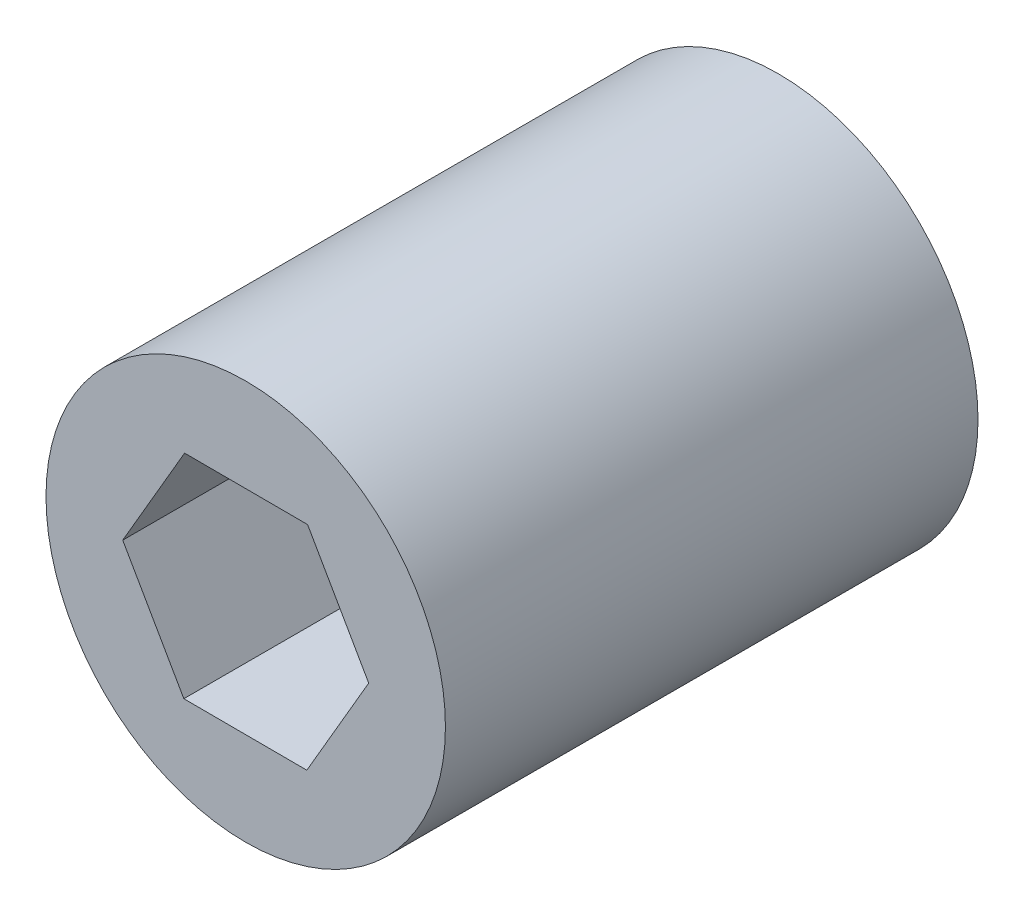
ISO-10303-21;
HEADER;
FILE_DESCRIPTION(('STEP AP214'),'2;1');
FILE_NAME('part.step','',(''),(''),'','','');
FILE_SCHEMA(('AUTOMOTIVE_DESIGN { 1 0 10303 214 1 1 1 1 }'));
ENDSEC;
DATA;
#1=APPLICATION_CONTEXT('core data for automotive mechanical design processes');
#2=APPLICATION_PROTOCOL_DEFINITION('international standard','automotive_design',2000,#1);
#3=PRODUCT_CONTEXT('',#1,'mechanical');
#4=PRODUCT('Part','Part','',(#3));
#5=PRODUCT_RELATED_PRODUCT_CATEGORY('part','',(#4));
#6=PRODUCT_DEFINITION_FORMATION('','',#4);
#7=PRODUCT_DEFINITION_CONTEXT('part definition',#1,'design');
#8=PRODUCT_DEFINITION('design','',#6,#7);
#9=PRODUCT_DEFINITION_SHAPE('','',#8);
#10=(LENGTH_UNIT() NAMED_UNIT(*) SI_UNIT(.MILLI.,.METRE.));
#11=(NAMED_UNIT(*) PLANE_ANGLE_UNIT() SI_UNIT($,.RADIAN.));
#12=(NAMED_UNIT(*) SI_UNIT($,.STERADIAN.) SOLID_ANGLE_UNIT());
#13=UNCERTAINTY_MEASURE_WITH_UNIT(LENGTH_MEASURE(1.E-05),#10,'distance_accuracy_value','');
#14=(GEOMETRIC_REPRESENTATION_CONTEXT(3) GLOBAL_UNCERTAINTY_ASSIGNED_CONTEXT((#13)) GLOBAL_UNIT_ASSIGNED_CONTEXT((#10,
#11,#12)) REPRESENTATION_CONTEXT('',''));
#15=CARTESIAN_POINT('',(0.,0.,0.));
#16=DIRECTION('',(0.,0.,1.));
#17=DIRECTION('',(1.,0.,0.));
#18=AXIS2_PLACEMENT_3D('',#15,#16,#17);
#19=CARTESIAN_POINT('',(7.82284209757141,-0.129316379386639,5.00004242994869));
#20=DIRECTION('',(0.,0.000327075531055584,0.999999946510797));
#21=DIRECTION('',(0.,-0.999999946510797,0.000327075531055584));
#22=AXIS2_PLACEMENT_3D('',#19,#20,#21);
#23=PLANE('',#22);
#24=DIRECTION('',(0.497117681505412,-0.867683081656791,0.000283797919865992));
#25=VECTOR('',#24,1.);
#26=CARTESIAN_POINT('',(4.36453768066593,0.799277461372291,4.99973870960886));
#27=LINE('',#26,#25);
#28=CARTESIAN_POINT('',(4.36453768066538,0.799277461208,4.99973820729856));
#29=VERTEX_POINT('',#28);
#30=CARTESIAN_POINT('',(4.82375532424365,-0.00225383585304351,5.00000087089756));
#31=VERTEX_POINT('',#30);
#32=EDGE_CURVE('E96',#29,#31,#27,.T.);
#33=ORIENTED_EDGE('',*,*,#32,.F.);
#34=DIRECTION('',(0.999994472094556,-0.00332502335797673,0.));
#35=VECTOR('',#34,1.);
#36=CARTESIAN_POINT('',(4.3645355042149,0.799277468280495,4.99973770498825));
#37=LINE('',#36,#35);
#38=CARTESIAN_POINT('',(3.44078194859939,0.802348987408997,4.99973770498825));
#39=VERTEX_POINT('',#38);
#40=EDGE_CURVE('E81',#39,#29,#37,.T.);
#41=ORIENTED_EDGE('',*,*,#40,.F.);
#42=DIRECTION('',(0.502876790589736,0.864358058654517,-0.000282710386165704));
#43=VECTOR('',#42,1.);
#44=CARTESIAN_POINT('',(2.97624467575638,0.00388921350831364,4.99999886165634));
#45=LINE('',#44,#43);
#46=CARTESIAN_POINT('',(2.97624467575638,0.00388921350832046,4.99999886165634));
#47=VERTEX_POINT('',#46);
#48=EDGE_CURVE('E65',#47,#39,#45,.T.);
#49=ORIENTED_EDGE('',*,*,#48,.F.);
#50=DIRECTION('',(-0.497117681505412,0.867683081656791,-0.000283797919868809));
#51=VECTOR('',#50,1.);
#52=CARTESIAN_POINT('',(3.4354623193341,-0.797642083717012,5.00026102294503));
#53=LINE('',#52,#51);
#54=CARTESIAN_POINT('',(3.43546231933436,-0.797642083634868,5.0002612741002));
#55=VERTEX_POINT('',#54);
#56=EDGE_CURVE('E70',#55,#47,#53,.T.);
#57=ORIENTED_EDGE('',*,*,#56,.F.);
#58=DIRECTION('',(-0.999994472094556,0.00332502335797678,0.));
#59=VECTOR('',#58,1.);
#60=CARTESIAN_POINT('',(3.43546014288526,-0.797642076151644,5.00026202756563));
#61=LINE('',#60,#59);
#62=CARTESIAN_POINT('',(4.35921723575482,-0.800713607041667,5.00026202756564));
#63=VERTEX_POINT('',#62);
#64=EDGE_CURVE('E104',#63,#55,#61,.T.);
#65=ORIENTED_EDGE('',*,*,#64,.F.);
#66=DIRECTION('',(-0.502876790589735,-0.864358058654517,0.000282710386158192));
#67=VECTOR('',#66,1.);
#68=CARTESIAN_POINT('',(4.82375532424365,-0.00225383585304146,5.00000087089755));
#69=LINE('',#68,#67);
#70=EDGE_CURVE('E101',#31,#63,#69,.T.);
#71=ORIENTED_EDGE('',*,*,#70,.F.);
#72=EDGE_LOOP('',(#33,#41,#49,#57,#65,#71));
#73=FACE_BOUND('',#72,.T.);
#74=ADVANCED_FACE('F17',(#73),#23,.T.);
#75=CARTESIAN_POINT('',(2.97624467575639,0.0045437839406435,7.00128093616331));
#76=DIRECTION('',(0.867683128068469,0.497117654914983,-0.00016259502967956));
#77=DIRECTION('',(-0.497117661486169,0.867683139538001,0.));
#78=AXIS2_PLACEMENT_3D('',#75,#76,#77);
#79=PLANE('',#78);
#80=ORIENTED_EDGE('',*,*,#56,.T.);
#81=DIRECTION('',(0.,-0.000327075531058723,-0.999999946510797));
#82=VECTOR('',#81,1.);
#83=CARTESIAN_POINT('',(2.97624467575639,0.00437982680490172,6.49999878142252));
#84=LINE('',#83,#82);
#85=CARTESIAN_POINT('',(2.97624467575639,0.00437982680490136,6.49999878142252));
#86=VERTEX_POINT('',#85);
#87=EDGE_CURVE('E72',#86,#47,#84,.T.);
#88=ORIENTED_EDGE('',*,*,#87,.F.);
#89=DIRECTION('',(-0.4971176815054,0.867683081656797,-0.000283797919899798));
#90=VECTOR('',#89,1.);
#91=CARTESIAN_POINT('',(3.43546231933409,-0.797151470420429,6.50026094271123));
#92=LINE('',#91,#90);
#93=CARTESIAN_POINT('',(3.43546272715701,-0.797151471776455,6.50026094271124));
#94=VERTEX_POINT('',#93);
#95=EDGE_CURVE('E107',#94,#86,#92,.T.);
#96=ORIENTED_EDGE('',*,*,#95,.F.);
#97=DIRECTION('',(1.08752776879921E-06,0.000327071914980552,0.999999946511388));
#98=VECTOR('',#97,1.);
#99=CARTESIAN_POINT('',(3.43546449578404,-0.796987520521477,7.00154309745204));
#100=LINE('',#99,#98);
#101=EDGE_CURVE('E75',#55,#94,#100,.T.);
#102=ORIENTED_EDGE('',*,*,#101,.F.);
#103=EDGE_LOOP('',(#80,#88,#96,#102));
#104=FACE_BOUND('',#103,.T.);
#105=ADVANCED_FACE('F71',(#104),#79,.T.);
#106=CARTESIAN_POINT('',(3.44078235642231,0.803003556485294,7.0010197794952));
#107=DIRECTION('',(0.864358104888343,-0.502876763691257,0.000164478693333617));
#108=DIRECTION('',(0.50287677049348,0.864358116580187,0.));
#109=AXIS2_PLACEMENT_3D('',#106,#107,#108);
#110=PLANE('',#109);
#111=ORIENTED_EDGE('',*,*,#48,.T.);
#112=DIRECTION('',(1.08752776879919E-06,0.000327071914980552,0.999999946511388));
#113=VECTOR('',#112,1.);
#114=CARTESIAN_POINT('',(3.4407829015817,0.803003555001203,7.00102078411581));
#115=LINE('',#114,#113);
#116=CARTESIAN_POINT('',(3.44078235642258,0.802839599431701,6.49973787590959));
#117=VERTEX_POINT('',#116);
#118=EDGE_CURVE('E83',#117,#39,#115,.F.);
#119=ORIENTED_EDGE('',*,*,#118,.F.);
#120=DIRECTION('',(0.502876790589736,0.864358058654516,-0.000282710386180727));
#121=VECTOR('',#120,1.);
#122=CARTESIAN_POINT('',(2.97624467575639,0.00437982680490152,6.49999878142251));
#123=LINE('',#122,#121);
#124=EDGE_CURVE('E87',#86,#117,#123,.T.);
#125=ORIENTED_EDGE('',*,*,#124,.F.);
#126=ORIENTED_EDGE('',*,*,#87,.T.);
#127=EDGE_LOOP('',(#111,#119,#125,#126));
#128=FACE_BOUND('',#127,.T.);
#129=ADVANCED_FACE('F85',(#128),#110,.T.);
#130=CARTESIAN_POINT('',(4.36453768066594,0.799932031804615,7.00102078411581));
#131=DIRECTION('',(-0.00332502318012585,-0.99999441860624,0.000327073723013166));
#132=DIRECTION('',(0.999994472094556,-0.00332502335797673,0.));
#133=AXIS2_PLACEMENT_3D('',#130,#131,#132);
#134=PLANE('',#133);
#135=ORIENTED_EDGE('',*,*,#40,.T.);
#136=DIRECTION('',(0.,-0.0003270755310547,-0.999999946510797));
#137=VECTOR('',#136,1.);
#138=CARTESIAN_POINT('',(4.36453768066593,0.799768074668873,6.49973862937505));
#139=LINE('',#138,#137);
#140=CARTESIAN_POINT('',(4.36453849631176,0.799768071956818,6.49973862937504));
#141=VERTEX_POINT('',#140);
#142=EDGE_CURVE('E93',#141,#29,#139,.T.);
#143=ORIENTED_EDGE('',*,*,#142,.F.);
#144=DIRECTION('',(0.999994472095147,-0.00332502300227246,1.08753371718988E-06));
#145=VECTOR('',#144,1.);
#146=CARTESIAN_POINT('',(3.44078235642231,0.802839599349555,6.49973762475441));
#147=LINE('',#146,#145);
#148=EDGE_CURVE('E110',#117,#141,#147,.T.);
#149=ORIENTED_EDGE('',*,*,#148,.F.);
#150=ORIENTED_EDGE('',*,*,#118,.T.);
#151=EDGE_LOOP('',(#135,#143,#149,#150));
#152=FACE_BOUND('',#151,.T.);
#153=ADVANCED_FACE('F185',(#152),#134,.T.);
#154=CARTESIAN_POINT('',(4.82375532424365,-0.00159926542071611,7.00128294540453));
#155=DIRECTION('',(-0.867683128068469,-0.497117654914983,0.00016259502967956));
#156=DIRECTION('',(0.497117661486169,-0.867683139538001,0.));
#157=AXIS2_PLACEMENT_3D('',#154,#155,#156);
#158=PLANE('',#157);
#159=ORIENTED_EDGE('',*,*,#32,.T.);
#160=DIRECTION('',(0.,-0.000327075531054814,-0.999999946510797));
#161=VECTOR('',#160,1.);
#162=CARTESIAN_POINT('',(4.82375532424366,-0.00176322255645923,6.50000079066377));
#163=LINE('',#162,#161);
#164=CARTESIAN_POINT('',(4.82375532424365,-0.00176322255645729,6.50000079066376));
#165=VERTEX_POINT('',#164);
#166=EDGE_CURVE('E98',#165,#31,#163,.T.);
#167=ORIENTED_EDGE('',*,*,#166,.F.);
#168=DIRECTION('',(0.497117681505406,-0.867683081656794,0.000283797919899796));
#169=VECTOR('',#168,1.);
#170=CARTESIAN_POINT('',(4.36453768066594,0.799768074668877,6.49973862937503));
#171=LINE('',#170,#169);
#172=EDGE_CURVE('E113',#141,#165,#171,.T.);
#173=ORIENTED_EDGE('',*,*,#172,.F.);
#174=ORIENTED_EDGE('',*,*,#142,.T.);
#175=EDGE_LOOP('',(#159,#167,#173,#174));
#176=FACE_BOUND('',#175,.T.);
#177=ADVANCED_FACE('F176',(#176),#158,.T.);
#178=CARTESIAN_POINT('',(4.35921764357774,-0.80005903796537,7.00154410207265));
#179=DIRECTION('',(-0.864358104888343,0.502876763691257,-0.000164478693333617));
#180=DIRECTION('',(-0.50287677049348,-0.864358116580187,0.));
#181=AXIS2_PLACEMENT_3D('',#178,#179,#180);
#182=PLANE('',#181);
#183=ORIENTED_EDGE('',*,*,#70,.T.);
#184=DIRECTION('',(1.08752776879921E-06,0.000327071914980552,0.999999946511388));
#185=VECTOR('',#184,1.);
#186=CARTESIAN_POINT('',(4.35921818873494,-0.800059040106626,7.00154309745204));
#187=LINE('',#186,#185);
#188=CARTESIAN_POINT('',(4.35921764357747,-0.800222995183254,6.5002616961767));
#189=VERTEX_POINT('',#188);
#190=EDGE_CURVE('E33',#189,#63,#187,.F.);
#191=ORIENTED_EDGE('',*,*,#190,.F.);
#192=DIRECTION('',(-0.502876790589729,-0.864358058654521,0.000282710386180729));
#193=VECTOR('',#192,1.);
#194=CARTESIAN_POINT('',(4.82375532424365,-0.00176322255645594,6.50000079066375));
#195=LINE('',#194,#193);
#196=EDGE_CURVE('E116',#165,#189,#195,.T.);
#197=ORIENTED_EDGE('',*,*,#196,.F.);
#198=ORIENTED_EDGE('',*,*,#166,.T.);
#199=EDGE_LOOP('',(#183,#191,#197,#198));
#200=FACE_BOUND('',#199,.T.);
#201=ADVANCED_FACE('F139',(#200),#182,.T.);
#202=CARTESIAN_POINT('',(3.43546231933411,-0.79698751328469,7.00154309745204));
#203=DIRECTION('',(0.0033250231801259,0.99999441860624,-0.000327073723013166));
#204=DIRECTION('',(-0.999994472094556,0.00332502335797678,0.));
#205=AXIS2_PLACEMENT_3D('',#202,#203,#204);
#206=PLANE('',#205);
#207=ORIENTED_EDGE('',*,*,#64,.T.);
#208=ORIENTED_EDGE('',*,*,#101,.T.);
#209=DIRECTION('',(-0.999994472095147,0.00332502300227345,-1.08753371718985E-06));
#210=VECTOR('',#209,1.);
#211=CARTESIAN_POINT('',(4.35921764357774,-0.800222995101108,6.50026194733185));
#212=LINE('',#211,#210);
#213=EDGE_CURVE('E119',#189,#94,#212,.T.);
#214=ORIENTED_EDGE('',*,*,#213,.F.);
#215=ORIENTED_EDGE('',*,*,#190,.T.);
#216=EDGE_LOOP('',(#207,#208,#214,#215));
#217=FACE_BOUND('',#216,.T.);
#218=ADVANCED_FACE('F130',(#217),#206,.T.);
#219=CARTESIAN_POINT('',(3.90000000000002,0.00130830212422172,6.49999978604313));
#220=DIRECTION('',(0.,0.000327075531055584,0.999999946510797));
#221=DIRECTION('',(0.,-0.999999946510797,0.000327075531055584));
#222=AXIS2_PLACEMENT_3D('',#219,#220,#221);
#223=PLANE('',#222);
#224=ORIENTED_EDGE('',*,*,#196,.T.);
#225=ORIENTED_EDGE('',*,*,#213,.T.);
#226=ORIENTED_EDGE('',*,*,#95,.T.);
#227=ORIENTED_EDGE('',*,*,#124,.T.);
#228=ORIENTED_EDGE('',*,*,#148,.T.);
#229=ORIENTED_EDGE('',*,*,#172,.T.);
#230=EDGE_LOOP('',(#224,#225,#226,#227,#228,#229));
#231=FACE_BOUND('',#230,.T.);
#232=CARTESIAN_POINT('',(3.90000000000002,0.00130830212422285,6.49999978604313));
#233=DIRECTION('',(0.,0.000327075531055584,0.999999946510797));
#234=DIRECTION('',(0.,-0.999999946510797,0.000327075531055584));
#235=AXIS2_PLACEMENT_3D('',#232,#233,#234);
#236=CIRCLE('',#235,1.5);
#237=CARTESIAN_POINT('',(3.90000000000002,-1.49869161764197,6.50049039933971));
#238=VERTEX_POINT('',#237);
#239=EDGE_CURVE('E20',#238,#238,#236,.F.);
#240=ORIENTED_EDGE('',*,*,#239,.F.);
#241=EDGE_LOOP('',(#240));
#242=FACE_BOUND('',#241,.T.);
#243=ADVANCED_FACE('F127',(#231,#242),#223,.T.);
#244=CARTESIAN_POINT('',(3.9,0.,2.49999999999998));
#245=DIRECTION('',(0.,0.000327075531055584,0.999999946510797));
#246=DIRECTION('',(0.,-0.999999946510797,0.000327075531055584));
#247=AXIS2_PLACEMENT_3D('',#244,#245,#246);
#248=PLANE('',#247);
#249=CARTESIAN_POINT('',(3.9,0.,2.49999999999999));
#250=DIRECTION('',(0.,0.000327075531055584,0.999999946510797));
#251=DIRECTION('',(0.,-0.999999946510797,0.000327075531055584));
#252=AXIS2_PLACEMENT_3D('',#249,#250,#251);
#253=CIRCLE('',#252,1.5);
#254=CARTESIAN_POINT('',(3.9,-1.4999999197662,2.50049061329657));
#255=VERTEX_POINT('',#254);
#256=EDGE_CURVE('E11',#255,#255,#253,.T.);
#257=ORIENTED_EDGE('',*,*,#256,.F.);
#258=EDGE_LOOP('',(#257));
#259=FACE_BOUND('',#258,.T.);
#260=ADVANCED_FACE('F129',(#259),#248,.F.);
#261=CARTESIAN_POINT('',(3.9,0.,2.49999999999998));
#262=DIRECTION('',(0.,0.000327075531055584,0.999999946510797));
#263=DIRECTION('',(0.,-0.999999946510797,0.000327075531055584));
#264=AXIS2_PLACEMENT_3D('',#261,#262,#263);
#265=CYLINDRICAL_SURFACE('',#264,1.5);
#266=ORIENTED_EDGE('',*,*,#256,.T.);
#267=EDGE_LOOP('',(#266));
#268=FACE_BOUND('',#267,.T.);
#269=ORIENTED_EDGE('',*,*,#239,.T.);
#270=EDGE_LOOP('',(#269));
#271=FACE_BOUND('',#270,.T.);
#272=ADVANCED_FACE('F125',(#268,#271),#265,.T.);
#273=CLOSED_SHELL('',(#74,#105,#129,#153,#177,#201,#218,#243,#260,#272));
#274=MANIFOLD_SOLID_BREP('B1',#273);
#275=ADVANCED_BREP_SHAPE_REPRESENTATION('',(#18,#274),#14);
#276=SHAPE_DEFINITION_REPRESENTATION(#9,#275);
ENDSEC;
END-ISO-10303-21;
